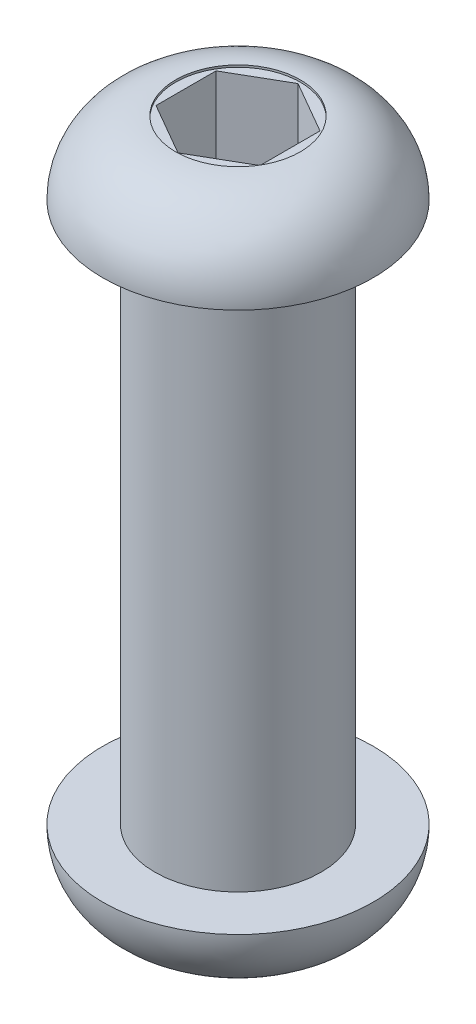
ISO-10303-21;
HEADER;
FILE_DESCRIPTION(('STEP AP214'),'2;1');
FILE_NAME('part.step','',(''),(''),'','','');
FILE_SCHEMA(('AUTOMOTIVE_DESIGN { 1 0 10303 214 1 1 1 1 }'));
ENDSEC;
DATA;
#1=APPLICATION_CONTEXT('core data for automotive mechanical design processes');
#2=APPLICATION_PROTOCOL_DEFINITION('international standard','automotive_design',2000,#1);
#3=PRODUCT_CONTEXT('',#1,'mechanical');
#4=PRODUCT('Part','Part','',(#3));
#5=PRODUCT_RELATED_PRODUCT_CATEGORY('part','',(#4));
#6=PRODUCT_DEFINITION_FORMATION('','',#4);
#7=PRODUCT_DEFINITION_CONTEXT('part definition',#1,'design');
#8=PRODUCT_DEFINITION('design','',#6,#7);
#9=PRODUCT_DEFINITION_SHAPE('','',#8);
#10=(LENGTH_UNIT() NAMED_UNIT(*) SI_UNIT(.MILLI.,.METRE.));
#11=(NAMED_UNIT(*) PLANE_ANGLE_UNIT() SI_UNIT($,.RADIAN.));
#12=(NAMED_UNIT(*) SI_UNIT($,.STERADIAN.) SOLID_ANGLE_UNIT());
#13=UNCERTAINTY_MEASURE_WITH_UNIT(LENGTH_MEASURE(1.E-05),#10,'distance_accuracy_value','');
#14=(GEOMETRIC_REPRESENTATION_CONTEXT(3) GLOBAL_UNCERTAINTY_ASSIGNED_CONTEXT((#13)) GLOBAL_UNIT_ASSIGNED_CONTEXT((#10,
#11,#12)) REPRESENTATION_CONTEXT('',''));
#15=CARTESIAN_POINT('',(0.,0.,0.));
#16=DIRECTION('',(0.,0.,1.));
#17=DIRECTION('',(1.,0.,0.));
#18=AXIS2_PLACEMENT_3D('',#15,#16,#17);
#19=CARTESIAN_POINT('',(1.25,-14.75,-0.721687836487033));
#20=DIRECTION('',(0.5,0.,-0.866025403784439));
#21=DIRECTION('',(-0.866025403784439,0.,-0.5));
#22=AXIS2_PLACEMENT_3D('',#19,#20,#21);
#23=PLANE('',#22);
#24=DIRECTION('',(-0.866025403784439,0.,-0.5));
#25=VECTOR('',#24,1.);
#26=CARTESIAN_POINT('',(1.25,-14.7,-0.721687836487033));
#27=LINE('',#26,#25);
#28=CARTESIAN_POINT('',(1.25,-14.7,-0.721687836487034));
#29=VERTEX_POINT('',#28);
#30=CARTESIAN_POINT('',(0.,-14.7,-1.44337567297407));
#31=VERTEX_POINT('',#30);
#32=EDGE_CURVE('E104',#29,#31,#27,.T.);
#33=ORIENTED_EDGE('',*,*,#32,.F.);
#34=DIRECTION('',(0.,1.,0.));
#35=VECTOR('',#34,1.);
#36=CARTESIAN_POINT('',(1.25,-14.75,-0.721687836487033));
#37=LINE('',#36,#35);
#38=CARTESIAN_POINT('',(1.25,1.7,-0.721687836487034));
#39=VERTEX_POINT('',#38);
#40=EDGE_CURVE('E167',#29,#39,#37,.T.);
#41=ORIENTED_EDGE('',*,*,#40,.T.);
#42=DIRECTION('',(0.866025403784439,0.,0.5));
#43=VECTOR('',#42,1.);
#44=CARTESIAN_POINT('',(1.25,1.7,-0.721687836487033));
#45=LINE('',#44,#43);
#46=CARTESIAN_POINT('',(0.,1.7,-1.44337567297407));
#47=VERTEX_POINT('',#46);
#48=EDGE_CURVE('E163',#47,#39,#45,.T.);
#49=ORIENTED_EDGE('',*,*,#48,.F.);
#50=DIRECTION('',(0.,1.,0.));
#51=VECTOR('',#50,1.);
#52=CARTESIAN_POINT('',(0.,-14.75,-1.44337567297407));
#53=LINE('',#52,#51);
#54=EDGE_CURVE('E157',#31,#47,#53,.T.);
#55=ORIENTED_EDGE('',*,*,#54,.F.);
#56=EDGE_LOOP('',(#33,#41,#49,#55));
#57=FACE_BOUND('',#56,.T.);
#58=ADVANCED_FACE('F89',(#57),#23,.F.);
#59=CARTESIAN_POINT('',(1.25,-14.75,0.721687836487032));
#60=DIRECTION('',(1.,0.,0.));
#61=DIRECTION('',(0.,0.,-1.));
#62=AXIS2_PLACEMENT_3D('',#59,#60,#61);
#63=PLANE('',#62);
#64=DIRECTION('',(0.,0.,-1.));
#65=VECTOR('',#64,1.);
#66=CARTESIAN_POINT('',(1.25,-14.7,0.721687836487032));
#67=LINE('',#66,#65);
#68=CARTESIAN_POINT('',(1.25,-14.7,0.721687836487032));
#69=VERTEX_POINT('',#68);
#70=EDGE_CURVE('E213',#69,#29,#67,.T.);
#71=ORIENTED_EDGE('',*,*,#70,.F.);
#72=DIRECTION('',(0.,1.,0.));
#73=VECTOR('',#72,1.);
#74=CARTESIAN_POINT('',(1.25,-14.75,0.721687836487032));
#75=LINE('',#74,#73);
#76=CARTESIAN_POINT('',(1.25,1.7,0.721687836487032));
#77=VERTEX_POINT('',#76);
#78=EDGE_CURVE('E172',#69,#77,#75,.T.);
#79=ORIENTED_EDGE('',*,*,#78,.T.);
#80=DIRECTION('',(0.,0.,1.));
#81=VECTOR('',#80,1.);
#82=CARTESIAN_POINT('',(1.25,1.7,0.721687836487032));
#83=LINE('',#82,#81);
#84=EDGE_CURVE('E197',#39,#77,#83,.T.);
#85=ORIENTED_EDGE('',*,*,#84,.F.);
#86=ORIENTED_EDGE('',*,*,#40,.F.);
#87=EDGE_LOOP('',(#71,#79,#85,#86));
#88=FACE_BOUND('',#87,.T.);
#89=ADVANCED_FACE('F212',(#88),#63,.F.);
#90=CARTESIAN_POINT('',(0.,-14.75,1.44337567297406));
#91=DIRECTION('',(0.5,0.,0.866025403784438));
#92=DIRECTION('',(0.866025403784439,0.,-0.5));
#93=AXIS2_PLACEMENT_3D('',#90,#91,#92);
#94=PLANE('',#93);
#95=DIRECTION('',(0.866025403784439,0.,-0.5));
#96=VECTOR('',#95,1.);
#97=CARTESIAN_POINT('',(0.,-14.7,1.44337567297406));
#98=LINE('',#97,#96);
#99=CARTESIAN_POINT('',(0.,-14.7,1.44337567297406));
#100=VERTEX_POINT('',#99);
#101=EDGE_CURVE('E189',#100,#69,#98,.T.);
#102=ORIENTED_EDGE('',*,*,#101,.F.);
#103=DIRECTION('',(0.,1.,0.));
#104=VECTOR('',#103,1.);
#105=CARTESIAN_POINT('',(0.,-14.75,1.44337567297406));
#106=LINE('',#105,#104);
#107=CARTESIAN_POINT('',(0.,1.7,1.44337567297406));
#108=VERTEX_POINT('',#107);
#109=EDGE_CURVE('E161',#100,#108,#106,.T.);
#110=ORIENTED_EDGE('',*,*,#109,.T.);
#111=DIRECTION('',(-0.866025403784439,0.,0.5));
#112=VECTOR('',#111,1.);
#113=CARTESIAN_POINT('',(0.,1.7,1.44337567297406));
#114=LINE('',#113,#112);
#115=EDGE_CURVE('E188',#77,#108,#114,.T.);
#116=ORIENTED_EDGE('',*,*,#115,.F.);
#117=ORIENTED_EDGE('',*,*,#78,.F.);
#118=EDGE_LOOP('',(#102,#110,#116,#117));
#119=FACE_BOUND('',#118,.T.);
#120=ADVANCED_FACE('F186',(#119),#94,.F.);
#121=CARTESIAN_POINT('',(-1.25,-14.75,0.721687836487032));
#122=DIRECTION('',(-0.5,0.,0.866025403784438));
#123=DIRECTION('',(0.866025403784439,0.,0.5));
#124=AXIS2_PLACEMENT_3D('',#121,#122,#123);
#125=PLANE('',#124);
#126=DIRECTION('',(0.866025403784439,0.,0.5));
#127=VECTOR('',#126,1.);
#128=CARTESIAN_POINT('',(-1.25,-14.7,0.721687836487032));
#129=LINE('',#128,#127);
#130=CARTESIAN_POINT('',(-1.25,-14.7,0.721687836487032));
#131=VERTEX_POINT('',#130);
#132=EDGE_CURVE('E150',#131,#100,#129,.T.);
#133=ORIENTED_EDGE('',*,*,#132,.F.);
#134=DIRECTION('',(0.,1.,0.));
#135=VECTOR('',#134,1.);
#136=CARTESIAN_POINT('',(-1.25,-14.75,0.721687836487032));
#137=LINE('',#136,#135);
#138=CARTESIAN_POINT('',(-1.25,1.7,0.721687836487032));
#139=VERTEX_POINT('',#138);
#140=EDGE_CURVE('E148',#131,#139,#137,.T.);
#141=ORIENTED_EDGE('',*,*,#140,.T.);
#142=DIRECTION('',(-0.866025403784439,0.,-0.5));
#143=VECTOR('',#142,1.);
#144=CARTESIAN_POINT('',(-1.25,1.7,0.721687836487032));
#145=LINE('',#144,#143);
#146=EDGE_CURVE('E195',#108,#139,#145,.T.);
#147=ORIENTED_EDGE('',*,*,#146,.F.);
#148=ORIENTED_EDGE('',*,*,#109,.F.);
#149=EDGE_LOOP('',(#133,#141,#147,#148));
#150=FACE_BOUND('',#149,.T.);
#151=ADVANCED_FACE('F200',(#150),#125,.F.);
#152=CARTESIAN_POINT('',(-1.25,-14.75,-0.721687836487033));
#153=DIRECTION('',(-1.,0.,0.));
#154=DIRECTION('',(0.,0.,1.));
#155=AXIS2_PLACEMENT_3D('',#152,#153,#154);
#156=PLANE('',#155);
#157=DIRECTION('',(0.,0.,1.));
#158=VECTOR('',#157,1.);
#159=CARTESIAN_POINT('',(-1.25,-14.7,-0.721687836487033));
#160=LINE('',#159,#158);
#161=CARTESIAN_POINT('',(-1.25,-14.7,-0.721687836487033));
#162=VERTEX_POINT('',#161);
#163=EDGE_CURVE('E142',#162,#131,#160,.T.);
#164=ORIENTED_EDGE('',*,*,#163,.F.);
#165=DIRECTION('',(0.,1.,0.));
#166=VECTOR('',#165,1.);
#167=CARTESIAN_POINT('',(-1.25,-14.75,-0.721687836487033));
#168=LINE('',#167,#166);
#169=CARTESIAN_POINT('',(-1.25,1.7,-0.721687836487033));
#170=VERTEX_POINT('',#169);
#171=EDGE_CURVE('E112',#162,#170,#168,.T.);
#172=ORIENTED_EDGE('',*,*,#171,.T.);
#173=DIRECTION('',(0.,0.,-1.));
#174=VECTOR('',#173,1.);
#175=CARTESIAN_POINT('',(-1.25,1.7,-0.721687836487033));
#176=LINE('',#175,#174);
#177=EDGE_CURVE('E202',#139,#170,#176,.T.);
#178=ORIENTED_EDGE('',*,*,#177,.F.);
#179=ORIENTED_EDGE('',*,*,#140,.F.);
#180=EDGE_LOOP('',(#164,#172,#178,#179));
#181=FACE_BOUND('',#180,.T.);
#182=ADVANCED_FACE('F147',(#181),#156,.F.);
#183=CARTESIAN_POINT('',(0.,-14.75,-1.44337567297407));
#184=DIRECTION('',(-0.5,0.,-0.866025403784439));
#185=DIRECTION('',(-0.866025403784439,0.,0.5));
#186=AXIS2_PLACEMENT_3D('',#183,#184,#185);
#187=PLANE('',#186);
#188=DIRECTION('',(-0.866025403784439,0.,0.5));
#189=VECTOR('',#188,1.);
#190=CARTESIAN_POINT('',(0.,-14.7,-1.44337567297407));
#191=LINE('',#190,#189);
#192=EDGE_CURVE('E12',#31,#162,#191,.T.);
#193=ORIENTED_EDGE('',*,*,#192,.F.);
#194=ORIENTED_EDGE('',*,*,#54,.T.);
#195=DIRECTION('',(0.866025403784439,0.,-0.5));
#196=VECTOR('',#195,1.);
#197=CARTESIAN_POINT('',(0.,1.7,-1.44337567297407));
#198=LINE('',#197,#196);
#199=EDGE_CURVE('E98',#170,#47,#198,.T.);
#200=ORIENTED_EDGE('',*,*,#199,.F.);
#201=ORIENTED_EDGE('',*,*,#171,.F.);
#202=EDGE_LOOP('',(#193,#194,#200,#201));
#203=FACE_BOUND('',#202,.T.);
#204=ADVANCED_FACE('F154',(#203),#187,.F.);
#205=CARTESIAN_POINT('',(0.,0.,0.));
#206=DIRECTION('',(0.,1.,0.));
#207=DIRECTION('',(0.,0.,1.));
#208=AXIS2_PLACEMENT_3D('',#205,#206,#207);
#209=DEGENERATE_TOROIDAL_SURFACE('',#208,1.5,1.75,.T.);
#210=CARTESIAN_POINT('',(0.,0.,0.));
#211=DIRECTION('',(0.,1.,0.));
#212=DIRECTION('',(0.,0.,1.));
#213=AXIS2_PLACEMENT_3D('',#210,#211,#212);
#214=CIRCLE('',#213,3.25);
#215=CARTESIAN_POINT('',(0.,0.,3.25));
#216=VERTEX_POINT('',#215);
#217=EDGE_CURVE('E228',#216,#216,#214,.T.);
#218=ORIENTED_EDGE('',*,*,#217,.T.);
#219=EDGE_LOOP('',(#218));
#220=FACE_BOUND('',#219,.T.);
#221=CARTESIAN_POINT('',(0.,1.75,0.));
#222=DIRECTION('',(0.,1.,0.));
#223=DIRECTION('',(0.,0.,1.));
#224=AXIS2_PLACEMENT_3D('',#221,#222,#223);
#225=CIRCLE('',#224,1.5);
#226=CARTESIAN_POINT('',(0.,1.75,1.5));
#227=VERTEX_POINT('',#226);
#228=EDGE_CURVE('E232',#227,#227,#225,.T.);
#229=ORIENTED_EDGE('',*,*,#228,.F.);
#230=EDGE_LOOP('',(#229));
#231=FACE_BOUND('',#230,.T.);
#232=ADVANCED_FACE('F247',(#220,#231),#209,.T.);
#233=CARTESIAN_POINT('',(0.,1.7,0.));
#234=DIRECTION('',(0.,1.,0.));
#235=DIRECTION('',(0.,0.,1.));
#236=AXIS2_PLACEMENT_3D('',#233,#234,#235);
#237=PLANE('',#236);
#238=CARTESIAN_POINT('',(0.,1.7,0.));
#239=DIRECTION('',(0.,1.,0.));
#240=DIRECTION('',(0.,0.,1.));
#241=AXIS2_PLACEMENT_3D('',#238,#239,#240);
#242=CIRCLE('',#241,1.5);
#243=CARTESIAN_POINT('',(0.,1.7,1.5));
#244=VERTEX_POINT('',#243);
#245=EDGE_CURVE('E205',#244,#244,#242,.T.);
#246=ORIENTED_EDGE('',*,*,#245,.T.);
#247=EDGE_LOOP('',(#246));
#248=FACE_BOUND('',#247,.T.);
#249=ORIENTED_EDGE('',*,*,#48,.T.);
#250=ORIENTED_EDGE('',*,*,#84,.T.);
#251=ORIENTED_EDGE('',*,*,#115,.T.);
#252=ORIENTED_EDGE('',*,*,#146,.T.);
#253=ORIENTED_EDGE('',*,*,#177,.T.);
#254=ORIENTED_EDGE('',*,*,#199,.T.);
#255=EDGE_LOOP('',(#249,#250,#251,#252,#253,#254));
#256=FACE_BOUND('',#255,.T.);
#257=ADVANCED_FACE('F194',(#248,#256),#237,.T.);
#258=CARTESIAN_POINT('',(0.,1.7,0.));
#259=DIRECTION('',(0.,1.,0.));
#260=DIRECTION('',(0.,0.,1.));
#261=AXIS2_PLACEMENT_3D('',#258,#259,#260);
#262=CYLINDRICAL_SURFACE('',#261,1.5);
#263=ORIENTED_EDGE('',*,*,#245,.F.);
#264=EDGE_LOOP('',(#263));
#265=FACE_BOUND('',#264,.T.);
#266=ORIENTED_EDGE('',*,*,#228,.T.);
#267=EDGE_LOOP('',(#266));
#268=FACE_BOUND('',#267,.T.);
#269=ADVANCED_FACE('F245',(#265,#268),#262,.F.);
#270=CARTESIAN_POINT('',(0.,-13.,0.));
#271=DIRECTION('',(0.,1.,0.));
#272=DIRECTION('',(0.,0.,1.));
#273=AXIS2_PLACEMENT_3D('',#270,#271,#272);
#274=CYLINDRICAL_SURFACE('',#273,2.);
#275=CARTESIAN_POINT('',(0.,-13.,0.));
#276=DIRECTION('',(0.,1.,0.));
#277=DIRECTION('',(0.,0.,1.));
#278=AXIS2_PLACEMENT_3D('',#275,#276,#277);
#279=CIRCLE('',#278,2.);
#280=CARTESIAN_POINT('',(0.,-13.,2.));
#281=VERTEX_POINT('',#280);
#282=EDGE_CURVE('E223',#281,#281,#279,.T.);
#283=CARTESIAN_POINT('',(0.,0.,0.));
#284=DIRECTION('',(0.,1.,0.));
#285=DIRECTION('',(0.,0.,1.));
#286=AXIS2_PLACEMENT_3D('',#283,#284,#285);
#287=CIRCLE('',#286,2.);
#288=CARTESIAN_POINT('',(0.,0.,2.));
#289=VERTEX_POINT('',#288);
#290=EDGE_CURVE('E218',#289,#289,#287,.T.);
#291=CARTESIAN_POINT('',(0.,-13.,2.));
#292=CARTESIAN_POINT('',(0.,-12.8645833333333,2.));
#293=CARTESIAN_POINT('',(0.,-12.7291666666667,2.));
#294=CARTESIAN_POINT('',(0.,-12.4583333333333,2.));
#295=CARTESIAN_POINT('',(0.,-12.3229166666667,2.));
#296=CARTESIAN_POINT('',(0.,-12.0520833333333,2.));
#297=CARTESIAN_POINT('',(0.,-11.9166666666667,2.));
#298=CARTESIAN_POINT('',(0.,-11.6458333333333,2.));
#299=CARTESIAN_POINT('',(0.,-11.5104166666667,2.));
#300=CARTESIAN_POINT('',(0.,-11.2395833333333,2.));
#301=CARTESIAN_POINT('',(0.,-11.1041666666667,2.));
#302=CARTESIAN_POINT('',(0.,-10.8333333333333,2.));
#303=CARTESIAN_POINT('',(0.,-10.6979166666667,2.));
#304=CARTESIAN_POINT('',(0.,-10.4270833333333,2.));
#305=CARTESIAN_POINT('',(0.,-10.2916666666667,2.));
#306=CARTESIAN_POINT('',(0.,-10.0208333333333,2.));
#307=CARTESIAN_POINT('',(0.,-9.88541666666667,2.));
#308=CARTESIAN_POINT('',(0.,-9.61458333333333,2.));
#309=CARTESIAN_POINT('',(0.,-9.47916666666667,2.));
#310=CARTESIAN_POINT('',(0.,-9.20833333333333,2.));
#311=CARTESIAN_POINT('',(0.,-9.07291666666667,2.));
#312=CARTESIAN_POINT('',(0.,-8.80208333333333,2.));
#313=CARTESIAN_POINT('',(0.,-8.66666666666667,2.));
#314=CARTESIAN_POINT('',(0.,-8.39583333333333,2.));
#315=CARTESIAN_POINT('',(0.,-8.26041666666667,2.));
#316=CARTESIAN_POINT('',(0.,-7.98958333333333,2.));
#317=CARTESIAN_POINT('',(0.,-7.85416666666667,2.));
#318=CARTESIAN_POINT('',(0.,-7.58333333333333,2.));
#319=CARTESIAN_POINT('',(0.,-7.44791666666667,2.));
#320=CARTESIAN_POINT('',(0.,-7.17708333333333,2.));
#321=CARTESIAN_POINT('',(0.,-7.04166666666667,2.));
#322=CARTESIAN_POINT('',(0.,-6.77083333333333,2.));
#323=CARTESIAN_POINT('',(0.,-6.63541666666667,2.));
#324=CARTESIAN_POINT('',(0.,-6.36458333333333,2.));
#325=CARTESIAN_POINT('',(0.,-6.22916666666667,2.));
#326=CARTESIAN_POINT('',(0.,-5.95833333333333,2.));
#327=CARTESIAN_POINT('',(0.,-5.82291666666667,2.));
#328=CARTESIAN_POINT('',(0.,-5.55208333333333,2.));
#329=CARTESIAN_POINT('',(0.,-5.41666666666667,2.));
#330=CARTESIAN_POINT('',(0.,-5.14583333333333,2.));
#331=CARTESIAN_POINT('',(0.,-5.01041666666667,2.));
#332=CARTESIAN_POINT('',(0.,-4.73958333333333,2.));
#333=CARTESIAN_POINT('',(0.,-4.60416666666667,2.));
#334=CARTESIAN_POINT('',(0.,-4.33333333333333,2.));
#335=CARTESIAN_POINT('',(0.,-4.19791666666667,2.));
#336=CARTESIAN_POINT('',(0.,-3.92708333333333,2.));
#337=CARTESIAN_POINT('',(0.,-3.79166666666667,2.));
#338=CARTESIAN_POINT('',(0.,-3.52083333333333,2.));
#339=CARTESIAN_POINT('',(0.,-3.38541666666667,2.));
#340=CARTESIAN_POINT('',(0.,-3.11458333333333,2.));
#341=CARTESIAN_POINT('',(0.,-2.97916666666667,2.));
#342=CARTESIAN_POINT('',(0.,-2.70833333333333,2.));
#343=CARTESIAN_POINT('',(0.,-2.57291666666667,2.));
#344=CARTESIAN_POINT('',(0.,-2.30208333333333,2.));
#345=CARTESIAN_POINT('',(0.,-2.16666666666667,2.));
#346=CARTESIAN_POINT('',(0.,-1.89583333333333,2.));
#347=CARTESIAN_POINT('',(0.,-1.76041666666667,2.));
#348=CARTESIAN_POINT('',(0.,-1.48958333333333,2.));
#349=CARTESIAN_POINT('',(0.,-1.35416666666667,2.));
#350=CARTESIAN_POINT('',(0.,-1.08333333333333,2.));
#351=CARTESIAN_POINT('',(0.,-0.947916666666667,2.));
#352=CARTESIAN_POINT('',(0.,-0.677083333333334,2.));
#353=CARTESIAN_POINT('',(0.,-0.541666666666667,2.));
#354=CARTESIAN_POINT('',(0.,-0.270833333333334,2.));
#355=CARTESIAN_POINT('',(0.,-0.135416666666667,2.));
#356=CARTESIAN_POINT('',(0.,0.,2.));
#357=B_SPLINE_CURVE_WITH_KNOTS('',3,(#291,#292,#293,#294,#295,#296,#297,#298,#299,#300,#301,
#302,#303,#304,#305,#306,#307,#308,#309,#310,#311,#312,#313,#314,#315,#316,#317,#318,#319,#320,
#321,#322,#323,#324,#325,#326,#327,#328,#329,#330,#331,#332,#333,#334,#335,#336,#337,#338,#339,
#340,#341,#342,#343,#344,#345,#346,#347,#348,#349,#350,#351,#352,#353,#354,#355,#356),
.UNSPECIFIED.,.F.,.F.,(4,2,2,2,2,2,2,2,2,2,2,2,2,2,2,2,2,2,2,2,2,2,2,2,2,2,2,2,2,2,2,2,4),(0.,
0.40625,0.812500000000001,1.21875,1.625,2.03125,2.4375,2.84375,3.25,3.65625,4.0625,4.46875,
4.875,5.28125,5.6875,6.09375,6.5,6.90625,7.3125,7.71875,8.125,8.53125,8.9375,9.34375,9.75,
10.15625,10.5625,10.96875,11.375,11.78125,12.1875,12.59375,13.),.UNSPECIFIED.);
#358=EDGE_CURVE('BSEAM272',#281,#289,#357,.T.);
#359=ORIENTED_EDGE('',*,*,#282,.T.);
#360=ORIENTED_EDGE('',*,*,#290,.F.);
#361=ORIENTED_EDGE('',*,*,#358,.T.);
#362=ORIENTED_EDGE('',*,*,#358,.F.);
#363=EDGE_LOOP('',(#359,#361,#360,#362));
#364=FACE_BOUND('',#363,.T.);
#365=ADVANCED_FACE('F272',(#364),#274,.T.);
#366=CARTESIAN_POINT('',(0.,-13.,0.));
#367=DIRECTION('',(0.,1.,0.));
#368=DIRECTION('',(0.,0.,1.));
#369=AXIS2_PLACEMENT_3D('',#366,#367,#368);
#370=PLANE('',#369);
#371=ORIENTED_EDGE('',*,*,#282,.F.);
#372=EDGE_LOOP('',(#371));
#373=FACE_BOUND('',#372,.T.);
#374=CARTESIAN_POINT('',(0.,-13.,0.));
#375=DIRECTION('',(0.,1.,0.));
#376=DIRECTION('',(0.,0.,1.));
#377=AXIS2_PLACEMENT_3D('',#374,#375,#376);
#378=CIRCLE('',#377,3.25);
#379=CARTESIAN_POINT('',(0.,-13.,3.25));
#380=VERTEX_POINT('',#379);
#381=EDGE_CURVE('E227',#380,#380,#378,.T.);
#382=ORIENTED_EDGE('',*,*,#381,.T.);
#383=EDGE_LOOP('',(#382));
#384=FACE_BOUND('',#383,.T.);
#385=ADVANCED_FACE('F277',(#373,#384),#370,.T.);
#386=CARTESIAN_POINT('',(0.,0.,0.));
#387=DIRECTION('',(0.,1.,0.));
#388=DIRECTION('',(0.,0.,1.));
#389=AXIS2_PLACEMENT_3D('',#386,#387,#388);
#390=PLANE('',#389);
#391=ORIENTED_EDGE('',*,*,#290,.T.);
#392=EDGE_LOOP('',(#391));
#393=FACE_BOUND('',#392,.T.);
#394=ORIENTED_EDGE('',*,*,#217,.F.);
#395=EDGE_LOOP('',(#394));
#396=FACE_BOUND('',#395,.T.);
#397=ADVANCED_FACE('F279',(#393,#396),#390,.F.);
#398=CARTESIAN_POINT('',(0.,-13.,0.));
#399=DIRECTION('',(0.,1.,0.));
#400=DIRECTION('',(0.,0.,1.));
#401=AXIS2_PLACEMENT_3D('',#398,#399,#400);
#402=DEGENERATE_TOROIDAL_SURFACE('',#401,1.5,1.75,.T.);
#403=CARTESIAN_POINT('',(0.,-14.75,0.));
#404=DIRECTION('',(0.,-1.,0.));
#405=DIRECTION('',(0.,0.,-1.));
#406=AXIS2_PLACEMENT_3D('',#403,#404,#405);
#407=CIRCLE('',#406,1.5);
#408=CARTESIAN_POINT('',(0.,-14.75,-1.5));
#409=VERTEX_POINT('',#408);
#410=EDGE_CURVE('E298',#409,#409,#407,.T.);
#411=ORIENTED_EDGE('',*,*,#410,.F.);
#412=EDGE_LOOP('',(#411));
#413=FACE_BOUND('',#412,.T.);
#414=ORIENTED_EDGE('',*,*,#381,.F.);
#415=EDGE_LOOP('',(#414));
#416=FACE_BOUND('',#415,.T.);
#417=ADVANCED_FACE('F91',(#413,#416),#402,.T.);
#418=CARTESIAN_POINT('',(0.,-14.7,0.));
#419=DIRECTION('',(0.,-1.,0.));
#420=DIRECTION('',(0.,0.,-1.));
#421=AXIS2_PLACEMENT_3D('',#418,#419,#420);
#422=PLANE('',#421);
#423=CARTESIAN_POINT('',(0.,-14.7,0.));
#424=DIRECTION('',(0.,-1.,0.));
#425=DIRECTION('',(0.,0.,-1.));
#426=AXIS2_PLACEMENT_3D('',#423,#424,#425);
#427=CIRCLE('',#426,1.5);
#428=CARTESIAN_POINT('',(0.,-14.7,-1.5));
#429=VERTEX_POINT('',#428);
#430=EDGE_CURVE('E151',#429,#429,#427,.T.);
#431=ORIENTED_EDGE('',*,*,#430,.T.);
#432=EDGE_LOOP('',(#431));
#433=FACE_BOUND('',#432,.T.);
#434=ORIENTED_EDGE('',*,*,#32,.T.);
#435=ORIENTED_EDGE('',*,*,#192,.T.);
#436=ORIENTED_EDGE('',*,*,#163,.T.);
#437=ORIENTED_EDGE('',*,*,#132,.T.);
#438=ORIENTED_EDGE('',*,*,#101,.T.);
#439=ORIENTED_EDGE('',*,*,#70,.T.);
#440=EDGE_LOOP('',(#434,#435,#436,#437,#438,#439));
#441=FACE_BOUND('',#440,.T.);
#442=ADVANCED_FACE('F141',(#433,#441),#422,.T.);
#443=CARTESIAN_POINT('',(0.,-14.7,0.));
#444=DIRECTION('',(0.,-1.,0.));
#445=DIRECTION('',(0.,0.,-1.));
#446=AXIS2_PLACEMENT_3D('',#443,#444,#445);
#447=CYLINDRICAL_SURFACE('',#446,1.5);
#448=ORIENTED_EDGE('',*,*,#430,.F.);
#449=EDGE_LOOP('',(#448));
#450=FACE_BOUND('',#449,.T.);
#451=ORIENTED_EDGE('',*,*,#410,.T.);
#452=EDGE_LOOP('',(#451));
#453=FACE_BOUND('',#452,.T.);
#454=ADVANCED_FACE('F286',(#450,#453),#447,.F.);
#455=CLOSED_SHELL('',(#58,#89,#120,#151,#182,#204,#232,#257,#269,#365,#385,#397,#417,#442,#454));
#456=MANIFOLD_SOLID_BREP('B2',#455);
#457=ADVANCED_BREP_SHAPE_REPRESENTATION('',(#18,#456),#14);
#458=SHAPE_DEFINITION_REPRESENTATION(#9,#457);
ENDSEC;
END-ISO-10303-21;
